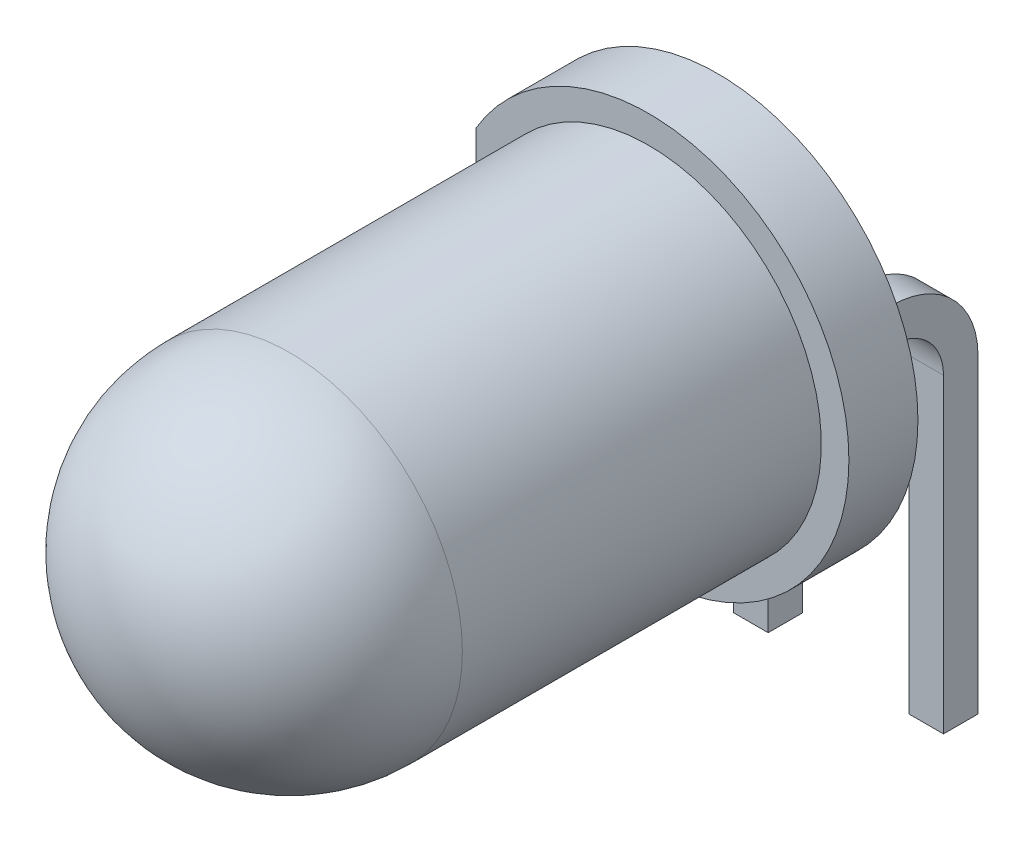
ISO-10303-21;
HEADER;
FILE_DESCRIPTION(('STEP AP214'),'2;1');
FILE_NAME('part.step','',(''),(''),'','','');
FILE_SCHEMA(('AUTOMOTIVE_DESIGN { 1 0 10303 214 1 1 1 1 }'));
ENDSEC;
DATA;
#1=APPLICATION_CONTEXT('core data for automotive mechanical design processes');
#2=APPLICATION_PROTOCOL_DEFINITION('international standard','automotive_design',2000,#1);
#3=PRODUCT_CONTEXT('',#1,'mechanical');
#4=PRODUCT('Part','Part','',(#3));
#5=PRODUCT_RELATED_PRODUCT_CATEGORY('part','',(#4));
#6=PRODUCT_DEFINITION_FORMATION('','',#4);
#7=PRODUCT_DEFINITION_CONTEXT('part definition',#1,'design');
#8=PRODUCT_DEFINITION('design','',#6,#7);
#9=PRODUCT_DEFINITION_SHAPE('','',#8);
#10=(LENGTH_UNIT() NAMED_UNIT(*) SI_UNIT(.MILLI.,.METRE.));
#11=(NAMED_UNIT(*) PLANE_ANGLE_UNIT() SI_UNIT($,.RADIAN.));
#12=(NAMED_UNIT(*) SI_UNIT($,.STERADIAN.) SOLID_ANGLE_UNIT());
#13=UNCERTAINTY_MEASURE_WITH_UNIT(LENGTH_MEASURE(1.E-05),#10,'distance_accuracy_value','');
#14=(GEOMETRIC_REPRESENTATION_CONTEXT(3) GLOBAL_UNCERTAINTY_ASSIGNED_CONTEXT((#13)) GLOBAL_UNIT_ASSIGNED_CONTEXT((#10,
#11,#12)) REPRESENTATION_CONTEXT('',''));
#15=CARTESIAN_POINT('',(0.,0.,0.));
#16=DIRECTION('',(0.,0.,1.));
#17=DIRECTION('',(1.,0.,0.));
#18=AXIS2_PLACEMENT_3D('',#15,#16,#17);
#19=CARTESIAN_POINT('',(0.,0.,1.));
#20=DIRECTION('',(0.,0.,1.));
#21=DIRECTION('',(1.,0.,0.));
#22=AXIS2_PLACEMENT_3D('',#19,#20,#21);
#23=PLANE('',#22);
#24=DIRECTION('',(0.,1.,0.));
#25=VECTOR('',#24,1.);
#26=CARTESIAN_POINT('',(-2.5,0.,1.));
#27=LINE('',#26,#25);
#28=CARTESIAN_POINT('',(-2.5,-1.46969384566991,1.));
#29=VERTEX_POINT('',#28);
#30=CARTESIAN_POINT('',(-2.5,0.,0.999999999999999));
#31=VERTEX_POINT('',#30);
#32=EDGE_CURVE('E301',#29,#31,#27,.T.);
#33=ORIENTED_EDGE('',*,*,#32,.F.);
#34=CARTESIAN_POINT('',(0.,0.,1.));
#35=DIRECTION('',(0.,0.,1.));
#36=DIRECTION('',(1.,0.,0.));
#37=AXIS2_PLACEMENT_3D('',#34,#35,#36);
#38=CIRCLE('',#37,2.9);
#39=CARTESIAN_POINT('',(-2.5,1.46969384566991,1.));
#40=VERTEX_POINT('',#39);
#41=EDGE_CURVE('E11',#29,#40,#38,.T.);
#42=ORIENTED_EDGE('',*,*,#41,.T.);
#43=EDGE_CURVE('E297',#31,#40,#27,.T.);
#44=ORIENTED_EDGE('',*,*,#43,.F.);
#45=CARTESIAN_POINT('',(0.,0.,1.));
#46=DIRECTION('',(0.,0.,-1.));
#47=DIRECTION('',(-1.,0.,0.));
#48=AXIS2_PLACEMENT_3D('',#45,#46,#47);
#49=CIRCLE('',#48,2.5);
#50=EDGE_CURVE('E307',#31,#31,#49,.T.);
#51=ORIENTED_EDGE('',*,*,#50,.T.);
#52=EDGE_LOOP('',(#33,#42,#44,#51));
#53=FACE_BOUND('',#52,.T.);
#54=ADVANCED_FACE('F37',(#53),#23,.T.);
#55=CARTESIAN_POINT('',(0.,0.,1.));
#56=DIRECTION('',(0.,0.,-1.));
#57=DIRECTION('',(-1.,0.,0.));
#58=AXIS2_PLACEMENT_3D('',#55,#56,#57);
#59=CYLINDRICAL_SURFACE('',#58,2.9);
#60=ORIENTED_EDGE('',*,*,#41,.F.);
#61=DIRECTION('',(0.,0.,-1.));
#62=VECTOR('',#61,1.);
#63=CARTESIAN_POINT('',(-2.5,-1.46969384566991,15.946257809569));
#64=LINE('',#63,#62);
#65=CARTESIAN_POINT('',(-2.5,-1.46969384566991,0.));
#66=VERTEX_POINT('',#65);
#67=EDGE_CURVE('E294',#29,#66,#64,.T.);
#68=ORIENTED_EDGE('',*,*,#67,.T.);
#69=CARTESIAN_POINT('',(0.,0.,0.));
#70=DIRECTION('',(0.,0.,1.));
#71=DIRECTION('',(1.,0.,0.));
#72=AXIS2_PLACEMENT_3D('',#69,#70,#71);
#73=CIRCLE('',#72,2.9);
#74=CARTESIAN_POINT('',(-2.5,1.46969384566991,0.));
#75=VERTEX_POINT('',#74);
#76=EDGE_CURVE('E41',#66,#75,#73,.T.);
#77=ORIENTED_EDGE('',*,*,#76,.T.);
#78=DIRECTION('',(0.,0.,-1.));
#79=VECTOR('',#78,1.);
#80=CARTESIAN_POINT('',(-2.5,1.46969384566991,15.946257809569));
#81=LINE('',#80,#79);
#82=EDGE_CURVE('E293',#40,#75,#81,.T.);
#83=ORIENTED_EDGE('',*,*,#82,.F.);
#84=EDGE_LOOP('',(#60,#68,#77,#83));
#85=FACE_BOUND('',#84,.T.);
#86=ADVANCED_FACE('F39',(#85),#59,.T.);
#87=CARTESIAN_POINT('',(0.,0.,0.));
#88=DIRECTION('',(0.,0.,1.));
#89=DIRECTION('',(1.,0.,0.));
#90=AXIS2_PLACEMENT_3D('',#87,#88,#89);
#91=PLANE('',#90);
#92=DIRECTION('',(1.,0.,0.));
#93=VECTOR('',#92,1.);
#94=CARTESIAN_POINT('',(-1.02,-0.25,0.));
#95=LINE('',#94,#93);
#96=CARTESIAN_POINT('',(-1.52,-0.25,0.));
#97=VERTEX_POINT('',#96);
#98=CARTESIAN_POINT('',(-1.02,-0.25,0.));
#99=VERTEX_POINT('',#98);
#100=EDGE_CURVE('E187',#97,#99,#95,.T.);
#101=ORIENTED_EDGE('',*,*,#100,.T.);
#102=DIRECTION('',(0.,1.,0.));
#103=VECTOR('',#102,1.);
#104=CARTESIAN_POINT('',(-1.02,0.25,0.));
#105=LINE('',#104,#103);
#106=CARTESIAN_POINT('',(-1.02,0.25,0.));
#107=VERTEX_POINT('',#106);
#108=EDGE_CURVE('E556',#99,#107,#105,.T.);
#109=ORIENTED_EDGE('',*,*,#108,.T.);
#110=DIRECTION('',(-1.,0.,0.));
#111=VECTOR('',#110,1.);
#112=CARTESIAN_POINT('',(-1.02,0.25,0.));
#113=LINE('',#112,#111);
#114=CARTESIAN_POINT('',(-1.52,0.25,0.));
#115=VERTEX_POINT('',#114);
#116=EDGE_CURVE('E191',#107,#115,#113,.T.);
#117=ORIENTED_EDGE('',*,*,#116,.T.);
#118=DIRECTION('',(0.,-1.,0.));
#119=VECTOR('',#118,1.);
#120=CARTESIAN_POINT('',(-1.52,0.25,0.));
#121=LINE('',#120,#119);
#122=EDGE_CURVE('E52',#115,#97,#121,.T.);
#123=ORIENTED_EDGE('',*,*,#122,.T.);
#124=EDGE_LOOP('',(#101,#109,#117,#123));
#125=FACE_BOUND('',#124,.T.);
#126=DIRECTION('',(1.,0.,0.));
#127=VECTOR('',#126,1.);
#128=CARTESIAN_POINT('',(1.52,-0.25,0.));
#129=LINE('',#128,#127);
#130=CARTESIAN_POINT('',(1.02,-0.25,0.));
#131=VERTEX_POINT('',#130);
#132=CARTESIAN_POINT('',(1.52,-0.25,0.));
#133=VERTEX_POINT('',#132);
#134=EDGE_CURVE('E236',#131,#133,#129,.T.);
#135=ORIENTED_EDGE('',*,*,#134,.T.);
#136=DIRECTION('',(0.,1.,0.));
#137=VECTOR('',#136,1.);
#138=CARTESIAN_POINT('',(1.52,0.25,0.));
#139=LINE('',#138,#137);
#140=CARTESIAN_POINT('',(1.52,0.25,0.));
#141=VERTEX_POINT('',#140);
#142=EDGE_CURVE('E231',#133,#141,#139,.T.);
#143=ORIENTED_EDGE('',*,*,#142,.T.);
#144=DIRECTION('',(-1.,0.,0.));
#145=VECTOR('',#144,1.);
#146=CARTESIAN_POINT('',(1.52,0.25,0.));
#147=LINE('',#146,#145);
#148=CARTESIAN_POINT('',(1.02,0.25,0.));
#149=VERTEX_POINT('',#148);
#150=EDGE_CURVE('E242',#141,#149,#147,.T.);
#151=ORIENTED_EDGE('',*,*,#150,.T.);
#152=DIRECTION('',(0.,-1.,0.));
#153=VECTOR('',#152,1.);
#154=CARTESIAN_POINT('',(1.02,0.25,0.));
#155=LINE('',#154,#153);
#156=EDGE_CURVE('E60',#149,#131,#155,.T.);
#157=ORIENTED_EDGE('',*,*,#156,.T.);
#158=EDGE_LOOP('',(#135,#143,#151,#157));
#159=FACE_BOUND('',#158,.T.);
#160=ORIENTED_EDGE('',*,*,#76,.F.);
#161=DIRECTION('',(0.,1.,0.));
#162=VECTOR('',#161,1.);
#163=CARTESIAN_POINT('',(-2.5,0.,0.));
#164=LINE('',#163,#162);
#165=EDGE_CURVE('E300',#66,#75,#164,.T.);
#166=ORIENTED_EDGE('',*,*,#165,.T.);
#167=EDGE_LOOP('',(#160,#166));
#168=FACE_BOUND('',#167,.T.);
#169=ADVANCED_FACE('F319',(#125,#159,#168),#91,.F.);
#170=CARTESIAN_POINT('',(0.,0.,6.19999981683501));
#171=DIRECTION('',(0.,0.,-1.));
#172=DIRECTION('',(1.,0.,0.));
#173=AXIS2_PLACEMENT_3D('',#170,#171,#172);
#174=SPHERICAL_SURFACE('',#173,2.50000009158249);
#175=CARTESIAN_POINT('',(0.,0.,6.19999981683501));
#176=DIRECTION('',(0.,0.,-1.));
#177=DIRECTION('',(-1.,0.,0.));
#178=AXIS2_PLACEMENT_3D('',#175,#176,#177);
#179=CIRCLE('',#178,2.5);
#180=CARTESIAN_POINT('',(-2.5,0.,6.19999981683501));
#181=VERTEX_POINT('',#180);
#182=EDGE_CURVE('E304',#181,#181,#179,.T.);
#183=ORIENTED_EDGE('',*,*,#182,.F.);
#184=EDGE_LOOP('',(#183));
#185=FACE_BOUND('',#184,.T.);
#186=ADVANCED_FACE('F328',(#185),#174,.T.);
#187=CARTESIAN_POINT('',(0.,0.,1.));
#188=DIRECTION('',(0.,0.,-1.));
#189=DIRECTION('',(-1.,0.,0.));
#190=AXIS2_PLACEMENT_3D('',#187,#188,#189);
#191=CYLINDRICAL_SURFACE('',#190,2.5);
#192=ORIENTED_EDGE('',*,*,#50,.F.);
#193=EDGE_LOOP('',(#192));
#194=FACE_BOUND('',#193,.T.);
#195=ORIENTED_EDGE('',*,*,#182,.T.);
#196=EDGE_LOOP('',(#195));
#197=FACE_BOUND('',#196,.T.);
#198=ADVANCED_FACE('F335',(#194,#197),#191,.T.);
#199=CARTESIAN_POINT('',(-2.5,1.46969384566991,15.946257809569));
#200=DIRECTION('',(1.,0.,0.));
#201=DIRECTION('',(0.,0.,-1.));
#202=AXIS2_PLACEMENT_3D('',#199,#200,#201);
#203=PLANE('',#202);
#204=ORIENTED_EDGE('',*,*,#67,.F.);
#205=ORIENTED_EDGE('',*,*,#32,.T.);
#206=ORIENTED_EDGE('',*,*,#43,.T.);
#207=ORIENTED_EDGE('',*,*,#82,.T.);
#208=ORIENTED_EDGE('',*,*,#165,.F.);
#209=EDGE_LOOP('',(#204,#205,#206,#207,#208));
#210=FACE_BOUND('',#209,.T.);
#211=ADVANCED_FACE('F321',(#210),#203,.F.);
#212=CARTESIAN_POINT('',(1.52,-1.,-1.75));
#213=DIRECTION('',(0.,0.,-1.));
#214=DIRECTION('',(0.,1.,0.));
#215=AXIS2_PLACEMENT_3D('',#212,#213,#214);
#216=PLANE('',#215);
#217=DIRECTION('',(1.,0.,0.));
#218=VECTOR('',#217,1.);
#219=CARTESIAN_POINT('',(1.52,-1.,-1.75));
#220=LINE('',#219,#218);
#221=CARTESIAN_POINT('',(1.02,-1.,-1.75));
#222=VERTEX_POINT('',#221);
#223=CARTESIAN_POINT('',(1.52,-1.,-1.75));
#224=VERTEX_POINT('',#223);
#225=EDGE_CURVE('E258',#222,#224,#220,.T.);
#226=ORIENTED_EDGE('',*,*,#225,.F.);
#227=DIRECTION('',(0.,-1.,0.));
#228=VECTOR('',#227,1.);
#229=CARTESIAN_POINT('',(1.02,-1.,-1.75));
#230=LINE('',#229,#228);
#231=CARTESIAN_POINT('',(1.02,-5.5,-1.75));
#232=VERTEX_POINT('',#231);
#233=EDGE_CURVE('E287',#222,#232,#230,.T.);
#234=ORIENTED_EDGE('',*,*,#233,.T.);
#235=DIRECTION('',(1.,0.,0.));
#236=VECTOR('',#235,1.);
#237=CARTESIAN_POINT('',(1.52,-5.5,-1.75));
#238=LINE('',#237,#236);
#239=CARTESIAN_POINT('',(1.52,-5.5,-1.75));
#240=VERTEX_POINT('',#239);
#241=EDGE_CURVE('E279',#232,#240,#238,.T.);
#242=ORIENTED_EDGE('',*,*,#241,.T.);
#243=DIRECTION('',(0.,-1.,0.));
#244=VECTOR('',#243,1.);
#245=CARTESIAN_POINT('',(1.52,-1.,-1.75));
#246=LINE('',#245,#244);
#247=EDGE_CURVE('E290',#224,#240,#246,.T.);
#248=ORIENTED_EDGE('',*,*,#247,.F.);
#249=EDGE_LOOP('',(#226,#234,#242,#248));
#250=FACE_BOUND('',#249,.T.);
#251=ADVANCED_FACE('F368',(#250),#216,.F.);
#252=CARTESIAN_POINT('',(1.52,-1.,-2.25));
#253=DIRECTION('',(0.,0.,1.));
#254=DIRECTION('',(0.,-1.,0.));
#255=AXIS2_PLACEMENT_3D('',#252,#253,#254);
#256=PLANE('',#255);
#257=DIRECTION('',(-1.,0.,0.));
#258=VECTOR('',#257,1.);
#259=CARTESIAN_POINT('',(1.52,-1.,-2.25));
#260=LINE('',#259,#258);
#261=CARTESIAN_POINT('',(1.52,-1.,-2.25));
#262=VERTEX_POINT('',#261);
#263=CARTESIAN_POINT('',(1.02,-1.,-2.25));
#264=VERTEX_POINT('',#263);
#265=EDGE_CURVE('E250',#262,#264,#260,.T.);
#266=ORIENTED_EDGE('',*,*,#265,.F.);
#267=DIRECTION('',(0.,-1.,0.));
#268=VECTOR('',#267,1.);
#269=CARTESIAN_POINT('',(1.52,-1.,-2.25));
#270=LINE('',#269,#268);
#271=CARTESIAN_POINT('',(1.52,-5.5,-2.25));
#272=VERTEX_POINT('',#271);
#273=EDGE_CURVE('E281',#262,#272,#270,.T.);
#274=ORIENTED_EDGE('',*,*,#273,.T.);
#275=DIRECTION('',(-1.,0.,0.));
#276=VECTOR('',#275,1.);
#277=CARTESIAN_POINT('',(1.52,-5.5,-2.25));
#278=LINE('',#277,#276);
#279=CARTESIAN_POINT('',(1.02,-5.5,-2.25));
#280=VERTEX_POINT('',#279);
#281=EDGE_CURVE('E275',#272,#280,#278,.T.);
#282=ORIENTED_EDGE('',*,*,#281,.T.);
#283=DIRECTION('',(0.,-1.,0.));
#284=VECTOR('',#283,1.);
#285=CARTESIAN_POINT('',(1.02,-1.,-2.25));
#286=LINE('',#285,#284);
#287=EDGE_CURVE('E284',#264,#280,#286,.T.);
#288=ORIENTED_EDGE('',*,*,#287,.F.);
#289=EDGE_LOOP('',(#266,#274,#282,#288));
#290=FACE_BOUND('',#289,.T.);
#291=ADVANCED_FACE('F359',(#290),#256,.F.);
#292=CARTESIAN_POINT('',(0.,-1.,-1.));
#293=DIRECTION('',(-1.,0.,0.));
#294=DIRECTION('',(0.,0.,1.));
#295=AXIS2_PLACEMENT_3D('',#292,#293,#294);
#296=CYLINDRICAL_SURFACE('',#295,0.75);
#297=DIRECTION('',(1.,0.,0.));
#298=VECTOR('',#297,1.);
#299=CARTESIAN_POINT('',(1.52,-0.25,-1.));
#300=LINE('',#299,#298);
#301=CARTESIAN_POINT('',(1.02,-0.25,-1.));
#302=VERTEX_POINT('',#301);
#303=CARTESIAN_POINT('',(1.52,-0.25,-1.));
#304=VERTEX_POINT('',#303);
#305=EDGE_CURVE('E235',#302,#304,#300,.T.);
#306=ORIENTED_EDGE('',*,*,#305,.F.);
#307=CARTESIAN_POINT('',(1.02,-1.,-1.));
#308=DIRECTION('',(-1.,0.,0.));
#309=DIRECTION('',(0.,0.,1.));
#310=AXIS2_PLACEMENT_3D('',#307,#308,#309);
#311=CIRCLE('',#310,0.75);
#312=EDGE_CURVE('E267',#302,#222,#311,.T.);
#313=ORIENTED_EDGE('',*,*,#312,.T.);
#314=ORIENTED_EDGE('',*,*,#225,.T.);
#315=CARTESIAN_POINT('',(1.52,-1.,-1.));
#316=DIRECTION('',(-1.,0.,0.));
#317=DIRECTION('',(0.,0.,1.));
#318=AXIS2_PLACEMENT_3D('',#315,#316,#317);
#319=CIRCLE('',#318,0.75);
#320=EDGE_CURVE('E270',#304,#224,#319,.T.);
#321=ORIENTED_EDGE('',*,*,#320,.F.);
#322=EDGE_LOOP('',(#306,#313,#314,#321));
#323=FACE_BOUND('',#322,.T.);
#324=ADVANCED_FACE('F370',(#323),#296,.F.);
#325=CARTESIAN_POINT('',(0.,-1.,-1.));
#326=DIRECTION('',(-1.,0.,0.));
#327=DIRECTION('',(0.,0.,1.));
#328=AXIS2_PLACEMENT_3D('',#325,#326,#327);
#329=CYLINDRICAL_SURFACE('',#328,1.25);
#330=DIRECTION('',(-1.,0.,0.));
#331=VECTOR('',#330,1.);
#332=CARTESIAN_POINT('',(1.52,0.25,-1.));
#333=LINE('',#332,#331);
#334=CARTESIAN_POINT('',(1.52,0.25,-1.));
#335=VERTEX_POINT('',#334);
#336=CARTESIAN_POINT('',(1.02,0.25,-1.));
#337=VERTEX_POINT('',#336);
#338=EDGE_CURVE('E232',#335,#337,#333,.T.);
#339=ORIENTED_EDGE('',*,*,#338,.F.);
#340=CARTESIAN_POINT('',(1.52,-1.,-1.));
#341=DIRECTION('',(-1.,0.,0.));
#342=DIRECTION('',(0.,0.,1.));
#343=AXIS2_PLACEMENT_3D('',#340,#341,#342);
#344=CIRCLE('',#343,1.25);
#345=EDGE_CURVE('E261',#335,#262,#344,.T.);
#346=ORIENTED_EDGE('',*,*,#345,.T.);
#347=ORIENTED_EDGE('',*,*,#265,.T.);
#348=CARTESIAN_POINT('',(1.02,-1.,-1.));
#349=DIRECTION('',(-1.,0.,0.));
#350=DIRECTION('',(0.,0.,1.));
#351=AXIS2_PLACEMENT_3D('',#348,#349,#350);
#352=CIRCLE('',#351,1.25);
#353=EDGE_CURVE('E264',#337,#264,#352,.T.);
#354=ORIENTED_EDGE('',*,*,#353,.F.);
#355=EDGE_LOOP('',(#339,#346,#347,#354));
#356=FACE_BOUND('',#355,.T.);
#357=ADVANCED_FACE('F356',(#356),#329,.T.);
#358=CARTESIAN_POINT('',(1.52,0.25,-1.));
#359=DIRECTION('',(1.,0.,0.));
#360=DIRECTION('',(0.,0.,-1.));
#361=AXIS2_PLACEMENT_3D('',#358,#359,#360);
#362=PLANE('',#361);
#363=ORIENTED_EDGE('',*,*,#142,.F.);
#364=DIRECTION('',(0.,0.,1.));
#365=VECTOR('',#364,1.);
#366=CARTESIAN_POINT('',(1.52,-0.25,-1.));
#367=LINE('',#366,#365);
#368=EDGE_CURVE('E248',#304,#133,#367,.T.);
#369=ORIENTED_EDGE('',*,*,#368,.F.);
#370=ORIENTED_EDGE('',*,*,#320,.T.);
#371=ORIENTED_EDGE('',*,*,#247,.T.);
#372=DIRECTION('',(0.,0.,-1.));
#373=VECTOR('',#372,1.);
#374=CARTESIAN_POINT('',(1.52,-5.5,-2.25));
#375=LINE('',#374,#373);
#376=EDGE_CURVE('E273',#240,#272,#375,.T.);
#377=ORIENTED_EDGE('',*,*,#376,.T.);
#378=ORIENTED_EDGE('',*,*,#273,.F.);
#379=ORIENTED_EDGE('',*,*,#345,.F.);
#380=DIRECTION('',(0.,0.,1.));
#381=VECTOR('',#380,1.);
#382=CARTESIAN_POINT('',(1.52,0.25,-1.));
#383=LINE('',#382,#381);
#384=EDGE_CURVE('E239',#335,#141,#383,.T.);
#385=ORIENTED_EDGE('',*,*,#384,.T.);
#386=EDGE_LOOP('',(#363,#369,#370,#371,#377,#378,#379,#385));
#387=FACE_BOUND('',#386,.T.);
#388=ADVANCED_FACE('F348',(#387),#362,.T.);
#389=CARTESIAN_POINT('',(1.52,-0.25,-1.));
#390=DIRECTION('',(0.,-1.,0.));
#391=DIRECTION('',(0.,0.,-1.));
#392=AXIS2_PLACEMENT_3D('',#389,#390,#391);
#393=PLANE('',#392);
#394=ORIENTED_EDGE('',*,*,#134,.F.);
#395=DIRECTION('',(0.,0.,1.));
#396=VECTOR('',#395,1.);
#397=CARTESIAN_POINT('',(1.02,-0.25,-1.));
#398=LINE('',#397,#396);
#399=EDGE_CURVE('E251',#302,#131,#398,.T.);
#400=ORIENTED_EDGE('',*,*,#399,.F.);
#401=ORIENTED_EDGE('',*,*,#305,.T.);
#402=ORIENTED_EDGE('',*,*,#368,.T.);
#403=EDGE_LOOP('',(#394,#400,#401,#402));
#404=FACE_BOUND('',#403,.T.);
#405=ADVANCED_FACE('F344',(#404),#393,.T.);
#406=CARTESIAN_POINT('',(1.02,0.25,-1.));
#407=DIRECTION('',(-1.,0.,0.));
#408=DIRECTION('',(0.,0.,1.));
#409=AXIS2_PLACEMENT_3D('',#406,#407,#408);
#410=PLANE('',#409);
#411=ORIENTED_EDGE('',*,*,#156,.F.);
#412=DIRECTION('',(0.,0.,1.));
#413=VECTOR('',#412,1.);
#414=CARTESIAN_POINT('',(1.02,0.25,-1.));
#415=LINE('',#414,#413);
#416=EDGE_CURVE('E253',#337,#149,#415,.T.);
#417=ORIENTED_EDGE('',*,*,#416,.F.);
#418=ORIENTED_EDGE('',*,*,#353,.T.);
#419=ORIENTED_EDGE('',*,*,#287,.T.);
#420=DIRECTION('',(0.,0.,1.));
#421=VECTOR('',#420,1.);
#422=CARTESIAN_POINT('',(1.02,-5.5,-2.25));
#423=LINE('',#422,#421);
#424=EDGE_CURVE('E277',#280,#232,#423,.T.);
#425=ORIENTED_EDGE('',*,*,#424,.T.);
#426=ORIENTED_EDGE('',*,*,#233,.F.);
#427=ORIENTED_EDGE('',*,*,#312,.F.);
#428=ORIENTED_EDGE('',*,*,#399,.T.);
#429=EDGE_LOOP('',(#411,#417,#418,#419,#425,#426,#427,#428));
#430=FACE_BOUND('',#429,.T.);
#431=ADVANCED_FACE('F354',(#430),#410,.T.);
#432=CARTESIAN_POINT('',(1.52,0.25,-1.));
#433=DIRECTION('',(0.,1.,0.));
#434=DIRECTION('',(0.,0.,1.));
#435=AXIS2_PLACEMENT_3D('',#432,#433,#434);
#436=PLANE('',#435);
#437=ORIENTED_EDGE('',*,*,#150,.F.);
#438=ORIENTED_EDGE('',*,*,#384,.F.);
#439=ORIENTED_EDGE('',*,*,#338,.T.);
#440=ORIENTED_EDGE('',*,*,#416,.T.);
#441=EDGE_LOOP('',(#437,#438,#439,#440));
#442=FACE_BOUND('',#441,.T.);
#443=ADVANCED_FACE('F353',(#442),#436,.T.);
#444=CARTESIAN_POINT('',(1.52,-5.5,-1.75));
#445=DIRECTION('',(0.,-1.,0.));
#446=DIRECTION('',(-1.,0.,0.));
#447=AXIS2_PLACEMENT_3D('',#444,#445,#446);
#448=PLANE('',#447);
#449=ORIENTED_EDGE('',*,*,#376,.F.);
#450=ORIENTED_EDGE('',*,*,#241,.F.);
#451=ORIENTED_EDGE('',*,*,#424,.F.);
#452=ORIENTED_EDGE('',*,*,#281,.F.);
#453=EDGE_LOOP('',(#449,#450,#451,#452));
#454=FACE_BOUND('',#453,.T.);
#455=ADVANCED_FACE('F365',(#454),#448,.T.);
#456=CARTESIAN_POINT('',(-1.02,-1.,-1.75));
#457=DIRECTION('',(0.,0.,-1.));
#458=DIRECTION('',(0.,1.,0.));
#459=AXIS2_PLACEMENT_3D('',#456,#457,#458);
#460=PLANE('',#459);
#461=DIRECTION('',(1.,0.,0.));
#462=VECTOR('',#461,1.);
#463=CARTESIAN_POINT('',(-1.02,-1.,-1.75));
#464=LINE('',#463,#462);
#465=CARTESIAN_POINT('',(-1.52,-1.,-1.75));
#466=VERTEX_POINT('',#465);
#467=CARTESIAN_POINT('',(-1.02,-1.,-1.75));
#468=VERTEX_POINT('',#467);
#469=EDGE_CURVE('E179',#466,#468,#464,.T.);
#470=ORIENTED_EDGE('',*,*,#469,.F.);
#471=DIRECTION('',(0.,-1.,0.));
#472=VECTOR('',#471,1.);
#473=CARTESIAN_POINT('',(-1.52,-1.,-1.75));
#474=LINE('',#473,#472);
#475=CARTESIAN_POINT('',(-1.52,-5.5,-1.75));
#476=VERTEX_POINT('',#475);
#477=EDGE_CURVE('E225',#466,#476,#474,.T.);
#478=ORIENTED_EDGE('',*,*,#477,.T.);
#479=DIRECTION('',(1.,0.,0.));
#480=VECTOR('',#479,1.);
#481=CARTESIAN_POINT('',(-1.02,-5.5,-1.75));
#482=LINE('',#481,#480);
#483=CARTESIAN_POINT('',(-1.02,-5.5,-1.75));
#484=VERTEX_POINT('',#483);
#485=EDGE_CURVE('E219',#476,#484,#482,.T.);
#486=ORIENTED_EDGE('',*,*,#485,.T.);
#487=DIRECTION('',(0.,-1.,0.));
#488=VECTOR('',#487,1.);
#489=CARTESIAN_POINT('',(-1.02,-1.,-1.75));
#490=LINE('',#489,#488);
#491=EDGE_CURVE('E228',#468,#484,#490,.T.);
#492=ORIENTED_EDGE('',*,*,#491,.F.);
#493=EDGE_LOOP('',(#470,#478,#486,#492));
#494=FACE_BOUND('',#493,.T.);
#495=ADVANCED_FACE('F458',(#494),#460,.F.);
#496=CARTESIAN_POINT('',(-1.02,-1.,-2.25));
#497=DIRECTION('',(0.,0.,1.));
#498=DIRECTION('',(0.,-1.,0.));
#499=AXIS2_PLACEMENT_3D('',#496,#497,#498);
#500=PLANE('',#499);
#501=DIRECTION('',(-1.,0.,0.));
#502=VECTOR('',#501,1.);
#503=CARTESIAN_POINT('',(-1.02,-1.,-2.25));
#504=LINE('',#503,#502);
#505=CARTESIAN_POINT('',(-1.02,-1.,-2.25));
#506=VERTEX_POINT('',#505);
#507=CARTESIAN_POINT('',(-1.52,-1.,-2.25));
#508=VERTEX_POINT('',#507);
#509=EDGE_CURVE('E201',#506,#508,#504,.T.);
#510=ORIENTED_EDGE('',*,*,#509,.F.);
#511=DIRECTION('',(0.,-1.,0.));
#512=VECTOR('',#511,1.);
#513=CARTESIAN_POINT('',(-1.02,-1.,-2.25));
#514=LINE('',#513,#512);
#515=CARTESIAN_POINT('',(-1.02,-5.5,-2.25));
#516=VERTEX_POINT('',#515);
#517=EDGE_CURVE('E174',#506,#516,#514,.T.);
#518=ORIENTED_EDGE('',*,*,#517,.T.);
#519=DIRECTION('',(-1.,0.,0.));
#520=VECTOR('',#519,1.);
#521=CARTESIAN_POINT('',(-1.02,-5.5,-2.25));
#522=LINE('',#521,#520);
#523=CARTESIAN_POINT('',(-1.52,-5.5,-2.25));
#524=VERTEX_POINT('',#523);
#525=EDGE_CURVE('E215',#516,#524,#522,.T.);
#526=ORIENTED_EDGE('',*,*,#525,.T.);
#527=DIRECTION('',(0.,-1.,0.));
#528=VECTOR('',#527,1.);
#529=CARTESIAN_POINT('',(-1.52,-1.,-2.25));
#530=LINE('',#529,#528);
#531=EDGE_CURVE('E222',#508,#524,#530,.T.);
#532=ORIENTED_EDGE('',*,*,#531,.F.);
#533=EDGE_LOOP('',(#510,#518,#526,#532));
#534=FACE_BOUND('',#533,.T.);
#535=ADVANCED_FACE('F467',(#534),#500,.F.);
#536=CARTESIAN_POINT('',(0.,-1.,-1.));
#537=DIRECTION('',(-1.,0.,0.));
#538=DIRECTION('',(0.,0.,1.));
#539=AXIS2_PLACEMENT_3D('',#536,#537,#538);
#540=CYLINDRICAL_SURFACE('',#539,0.75);
#541=DIRECTION('',(1.,0.,0.));
#542=VECTOR('',#541,1.);
#543=CARTESIAN_POINT('',(-1.02,-0.25,-1.));
#544=LINE('',#543,#542);
#545=CARTESIAN_POINT('',(-1.52,-0.25,-1.));
#546=VERTEX_POINT('',#545);
#547=CARTESIAN_POINT('',(-1.02,-0.25,-1.));
#548=VERTEX_POINT('',#547);
#549=EDGE_CURVE('E186',#546,#548,#544,.T.);
#550=ORIENTED_EDGE('',*,*,#549,.F.);
#551=CARTESIAN_POINT('',(-1.52,-1.,-1.));
#552=DIRECTION('',(-1.,0.,0.));
#553=DIRECTION('',(0.,0.,1.));
#554=AXIS2_PLACEMENT_3D('',#551,#552,#553);
#555=CIRCLE('',#554,0.75);
#556=EDGE_CURVE('E207',#546,#466,#555,.T.);
#557=ORIENTED_EDGE('',*,*,#556,.T.);
#558=ORIENTED_EDGE('',*,*,#469,.T.);
#559=CARTESIAN_POINT('',(-1.02,-1.,-1.));
#560=DIRECTION('',(-1.,0.,0.));
#561=DIRECTION('',(0.,0.,1.));
#562=AXIS2_PLACEMENT_3D('',#559,#560,#561);
#563=CIRCLE('',#562,0.75);
#564=EDGE_CURVE('E210',#548,#468,#563,.T.);
#565=ORIENTED_EDGE('',*,*,#564,.F.);
#566=EDGE_LOOP('',(#550,#557,#558,#565));
#567=FACE_BOUND('',#566,.T.);
#568=ADVANCED_FACE('F477',(#567),#540,.F.);
#569=CARTESIAN_POINT('',(0.,-1.,-1.));
#570=DIRECTION('',(-1.,0.,0.));
#571=DIRECTION('',(0.,0.,1.));
#572=AXIS2_PLACEMENT_3D('',#569,#570,#571);
#573=CYLINDRICAL_SURFACE('',#572,1.25);
#574=DIRECTION('',(-1.,0.,0.));
#575=VECTOR('',#574,1.);
#576=CARTESIAN_POINT('',(-1.02,0.25,-1.));
#577=LINE('',#576,#575);
#578=CARTESIAN_POINT('',(-1.02,0.25,-1.));
#579=VERTEX_POINT('',#578);
#580=CARTESIAN_POINT('',(-1.52,0.25,-1.));
#581=VERTEX_POINT('',#580);
#582=EDGE_CURVE('E182',#579,#581,#577,.T.);
#583=ORIENTED_EDGE('',*,*,#582,.F.);
#584=CARTESIAN_POINT('',(-1.02,-1.,-1.));
#585=DIRECTION('',(-1.,0.,0.));
#586=DIRECTION('',(0.,0.,1.));
#587=AXIS2_PLACEMENT_3D('',#584,#585,#586);
#588=CIRCLE('',#587,1.25);
#589=EDGE_CURVE('E166',#579,#506,#588,.T.);
#590=ORIENTED_EDGE('',*,*,#589,.T.);
#591=ORIENTED_EDGE('',*,*,#509,.T.);
#592=CARTESIAN_POINT('',(-1.52,-1.,-1.));
#593=DIRECTION('',(-1.,0.,0.));
#594=DIRECTION('',(0.,0.,1.));
#595=AXIS2_PLACEMENT_3D('',#592,#593,#594);
#596=CIRCLE('',#595,1.25);
#597=EDGE_CURVE('E178',#581,#508,#596,.T.);
#598=ORIENTED_EDGE('',*,*,#597,.F.);
#599=EDGE_LOOP('',(#583,#590,#591,#598));
#600=FACE_BOUND('',#599,.T.);
#601=ADVANCED_FACE('F183',(#600),#573,.T.);
#602=CARTESIAN_POINT('',(-1.02,0.25,-1.));
#603=DIRECTION('',(1.,0.,0.));
#604=DIRECTION('',(0.,0.,-1.));
#605=AXIS2_PLACEMENT_3D('',#602,#603,#604);
#606=PLANE('',#605);
#607=ORIENTED_EDGE('',*,*,#108,.F.);
#608=DIRECTION('',(0.,0.,1.));
#609=VECTOR('',#608,1.);
#610=CARTESIAN_POINT('',(-1.02,-0.25,-1.));
#611=LINE('',#610,#609);
#612=EDGE_CURVE('E203',#548,#99,#611,.T.);
#613=ORIENTED_EDGE('',*,*,#612,.F.);
#614=ORIENTED_EDGE('',*,*,#564,.T.);
#615=ORIENTED_EDGE('',*,*,#491,.T.);
#616=DIRECTION('',(0.,0.,-1.));
#617=VECTOR('',#616,1.);
#618=CARTESIAN_POINT('',(-1.02,-5.5,-2.25));
#619=LINE('',#618,#617);
#620=EDGE_CURVE('E213',#484,#516,#619,.T.);
#621=ORIENTED_EDGE('',*,*,#620,.T.);
#622=ORIENTED_EDGE('',*,*,#517,.F.);
#623=ORIENTED_EDGE('',*,*,#589,.F.);
#624=DIRECTION('',(0.,0.,1.));
#625=VECTOR('',#624,1.);
#626=CARTESIAN_POINT('',(-1.02,0.25,-1.));
#627=LINE('',#626,#625);
#628=EDGE_CURVE('E171',#579,#107,#627,.T.);
#629=ORIENTED_EDGE('',*,*,#628,.T.);
#630=EDGE_LOOP('',(#607,#613,#614,#615,#621,#622,#623,#629));
#631=FACE_BOUND('',#630,.T.);
#632=ADVANCED_FACE('F169',(#631),#606,.T.);
#633=CARTESIAN_POINT('',(-1.02,-0.25,-1.));
#634=DIRECTION('',(0.,-1.,0.));
#635=DIRECTION('',(0.,0.,-1.));
#636=AXIS2_PLACEMENT_3D('',#633,#634,#635);
#637=PLANE('',#636);
#638=ORIENTED_EDGE('',*,*,#100,.F.);
#639=DIRECTION('',(0.,0.,1.));
#640=VECTOR('',#639,1.);
#641=CARTESIAN_POINT('',(-1.52,-0.25,-1.));
#642=LINE('',#641,#640);
#643=EDGE_CURVE('E195',#546,#97,#642,.T.);
#644=ORIENTED_EDGE('',*,*,#643,.F.);
#645=ORIENTED_EDGE('',*,*,#549,.T.);
#646=ORIENTED_EDGE('',*,*,#612,.T.);
#647=EDGE_LOOP('',(#638,#644,#645,#646));
#648=FACE_BOUND('',#647,.T.);
#649=ADVANCED_FACE('F505',(#648),#637,.T.);
#650=CARTESIAN_POINT('',(-1.52,0.25,-1.));
#651=DIRECTION('',(-1.,0.,0.));
#652=DIRECTION('',(0.,0.,1.));
#653=AXIS2_PLACEMENT_3D('',#650,#651,#652);
#654=PLANE('',#653);
#655=ORIENTED_EDGE('',*,*,#122,.F.);
#656=DIRECTION('',(0.,0.,1.));
#657=VECTOR('',#656,1.);
#658=CARTESIAN_POINT('',(-1.52,0.25,-1.));
#659=LINE('',#658,#657);
#660=EDGE_CURVE('E193',#581,#115,#659,.T.);
#661=ORIENTED_EDGE('',*,*,#660,.F.);
#662=ORIENTED_EDGE('',*,*,#597,.T.);
#663=ORIENTED_EDGE('',*,*,#531,.T.);
#664=DIRECTION('',(0.,0.,1.));
#665=VECTOR('',#664,1.);
#666=CARTESIAN_POINT('',(-1.52,-5.5,-2.25));
#667=LINE('',#666,#665);
#668=EDGE_CURVE('E217',#524,#476,#667,.T.);
#669=ORIENTED_EDGE('',*,*,#668,.T.);
#670=ORIENTED_EDGE('',*,*,#477,.F.);
#671=ORIENTED_EDGE('',*,*,#556,.F.);
#672=ORIENTED_EDGE('',*,*,#643,.T.);
#673=EDGE_LOOP('',(#655,#661,#662,#663,#669,#670,#671,#672));
#674=FACE_BOUND('',#673,.T.);
#675=ADVANCED_FACE('F515',(#674),#654,.T.);
#676=CARTESIAN_POINT('',(-1.02,0.25,-1.));
#677=DIRECTION('',(0.,1.,0.));
#678=DIRECTION('',(0.,0.,1.));
#679=AXIS2_PLACEMENT_3D('',#676,#677,#678);
#680=PLANE('',#679);
#681=ORIENTED_EDGE('',*,*,#116,.F.);
#682=ORIENTED_EDGE('',*,*,#628,.F.);
#683=ORIENTED_EDGE('',*,*,#582,.T.);
#684=ORIENTED_EDGE('',*,*,#660,.T.);
#685=EDGE_LOOP('',(#681,#682,#683,#684));
#686=FACE_BOUND('',#685,.T.);
#687=ADVANCED_FACE('F189',(#686),#680,.T.);
#688=CARTESIAN_POINT('',(-1.02,-5.5,-1.75));
#689=DIRECTION('',(0.,-1.,0.));
#690=DIRECTION('',(-1.,0.,0.));
#691=AXIS2_PLACEMENT_3D('',#688,#689,#690);
#692=PLANE('',#691);
#693=ORIENTED_EDGE('',*,*,#620,.F.);
#694=ORIENTED_EDGE('',*,*,#485,.F.);
#695=ORIENTED_EDGE('',*,*,#668,.F.);
#696=ORIENTED_EDGE('',*,*,#525,.F.);
#697=EDGE_LOOP('',(#693,#694,#695,#696));
#698=FACE_BOUND('',#697,.T.);
#699=ADVANCED_FACE('F535',(#698),#692,.T.);
#700=CLOSED_SHELL('',(#54,#86,#169,#186,#198,#211,#251,#291,#324,#357,#388,#405,#431,#443,#455,
#495,#535,#568,#601,#632,#649,#675,#687,#699));
#701=MANIFOLD_SOLID_BREP('B2',#700);
#702=ADVANCED_BREP_SHAPE_REPRESENTATION('',(#18,#701),#14);
#703=SHAPE_DEFINITION_REPRESENTATION(#9,#702);
ENDSEC;
END-ISO-10303-21;
